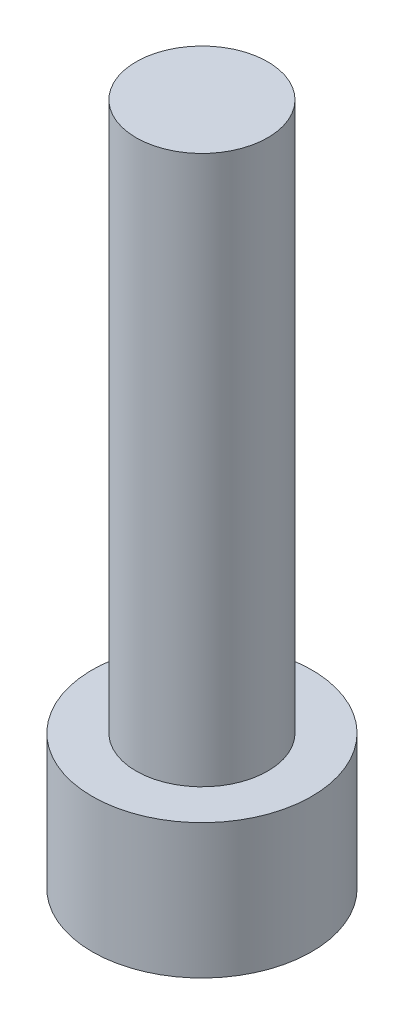
ISO-10303-21;
HEADER;
FILE_DESCRIPTION(('STEP AP214'),'2;1');
FILE_NAME('part.step','',(''),(''),'','','');
FILE_SCHEMA(('AUTOMOTIVE_DESIGN { 1 0 10303 214 1 1 1 1 }'));
ENDSEC;
DATA;
#1=APPLICATION_CONTEXT('core data for automotive mechanical design processes');
#2=APPLICATION_PROTOCOL_DEFINITION('international standard','automotive_design',2000,#1);
#3=PRODUCT_CONTEXT('',#1,'mechanical');
#4=PRODUCT('Part','Part','',(#3));
#5=PRODUCT_RELATED_PRODUCT_CATEGORY('part','',(#4));
#6=PRODUCT_DEFINITION_FORMATION('','',#4);
#7=PRODUCT_DEFINITION_CONTEXT('part definition',#1,'design');
#8=PRODUCT_DEFINITION('design','',#6,#7);
#9=PRODUCT_DEFINITION_SHAPE('','',#8);
#10=(LENGTH_UNIT() NAMED_UNIT(*) SI_UNIT(.MILLI.,.METRE.));
#11=(NAMED_UNIT(*) PLANE_ANGLE_UNIT() SI_UNIT($,.RADIAN.));
#12=(NAMED_UNIT(*) SI_UNIT($,.STERADIAN.) SOLID_ANGLE_UNIT());
#13=UNCERTAINTY_MEASURE_WITH_UNIT(LENGTH_MEASURE(1.E-05),#10,'distance_accuracy_value','');
#14=(GEOMETRIC_REPRESENTATION_CONTEXT(3) GLOBAL_UNCERTAINTY_ASSIGNED_CONTEXT((#13)) GLOBAL_UNIT_ASSIGNED_CONTEXT((#10,
#11,#12)) REPRESENTATION_CONTEXT('',''));
#15=CARTESIAN_POINT('',(0.,0.,0.));
#16=DIRECTION('',(0.,0.,1.));
#17=DIRECTION('',(1.,0.,0.));
#18=AXIS2_PLACEMENT_3D('',#15,#16,#17);
#19=CARTESIAN_POINT('',(0.,3.5052,0.));
#20=DIRECTION('',(0.,1.,0.));
#21=DIRECTION('',(0.,0.,1.));
#22=AXIS2_PLACEMENT_3D('',#19,#20,#21);
#23=PLANE('',#22);
#24=CARTESIAN_POINT('',(0.,3.5052,0.));
#25=DIRECTION('',(0.,1.,0.));
#26=DIRECTION('',(0.,0.,1.));
#27=AXIS2_PLACEMENT_3D('',#24,#25,#26);
#28=CIRCLE('',#27,2.8575);
#29=CARTESIAN_POINT('',(0.,3.5052,2.8575));
#30=VERTEX_POINT('',#29);
#31=EDGE_CURVE('E11',#30,#30,#28,.T.);
#32=ORIENTED_EDGE('',*,*,#31,.T.);
#33=EDGE_LOOP('',(#32));
#34=FACE_BOUND('',#33,.T.);
#35=CARTESIAN_POINT('',(0.,3.5052,0.));
#36=DIRECTION('',(0.,1.,0.));
#37=DIRECTION('',(0.,0.,1.));
#38=AXIS2_PLACEMENT_3D('',#35,#36,#37);
#39=CIRCLE('',#38,1.7145);
#40=CARTESIAN_POINT('',(0.,3.5052,1.7145));
#41=VERTEX_POINT('',#40);
#42=EDGE_CURVE('E152',#41,#41,#39,.T.);
#43=ORIENTED_EDGE('',*,*,#42,.F.);
#44=EDGE_LOOP('',(#43));
#45=FACE_BOUND('',#44,.T.);
#46=ADVANCED_FACE('F33',(#34,#45),#23,.T.);
#47=CARTESIAN_POINT('',(0.,3.5052,0.));
#48=DIRECTION('',(0.,-1.,0.));
#49=DIRECTION('',(0.,0.,-1.));
#50=AXIS2_PLACEMENT_3D('',#47,#48,#49);
#51=CYLINDRICAL_SURFACE('',#50,2.8575);
#52=ORIENTED_EDGE('',*,*,#31,.F.);
#53=EDGE_LOOP('',(#52));
#54=FACE_BOUND('',#53,.T.);
#55=CARTESIAN_POINT('',(0.,0.,0.));
#56=DIRECTION('',(0.,1.,0.));
#57=DIRECTION('',(0.,0.,1.));
#58=AXIS2_PLACEMENT_3D('',#55,#56,#57);
#59=CIRCLE('',#58,2.8575);
#60=CARTESIAN_POINT('',(0.,0.,2.8575));
#61=VERTEX_POINT('',#60);
#62=EDGE_CURVE('E37',#61,#61,#59,.T.);
#63=ORIENTED_EDGE('',*,*,#62,.T.);
#64=EDGE_LOOP('',(#63));
#65=FACE_BOUND('',#64,.T.);
#66=ADVANCED_FACE('F35',(#54,#65),#51,.T.);
#67=CARTESIAN_POINT('',(0.,0.,0.));
#68=DIRECTION('',(0.,1.,0.));
#69=DIRECTION('',(0.,0.,1.));
#70=AXIS2_PLACEMENT_3D('',#67,#68,#69);
#71=PLANE('',#70);
#72=DIRECTION('',(-0.500000000000001,0.,0.866025403784438));
#73=VECTOR('',#72,1.);
#74=CARTESIAN_POINT('',(1.60395121659243,0.,0.));
#75=LINE('',#74,#73);
#76=CARTESIAN_POINT('',(1.60395121659243,0.,0.));
#77=VERTEX_POINT('',#76);
#78=CARTESIAN_POINT('',(0.801975608296214,0.,1.3890625));
#79=VERTEX_POINT('',#78);
#80=EDGE_CURVE('E122',#77,#79,#75,.T.);
#81=ORIENTED_EDGE('',*,*,#80,.F.);
#82=DIRECTION('',(0.5,0.,0.866025403784439));
#83=VECTOR('',#82,1.);
#84=CARTESIAN_POINT('',(0.801975608296215,0.,-1.3890625));
#85=LINE('',#84,#83);
#86=CARTESIAN_POINT('',(0.801975608296215,0.,-1.3890625));
#87=VERTEX_POINT('',#86);
#88=EDGE_CURVE('E48',#87,#77,#85,.T.);
#89=ORIENTED_EDGE('',*,*,#88,.F.);
#90=DIRECTION('',(1.,0.,0.));
#91=VECTOR('',#90,1.);
#92=CARTESIAN_POINT('',(-0.801975608296214,0.,-1.3890625));
#93=LINE('',#92,#91);
#94=CARTESIAN_POINT('',(-0.801975608296214,0.,-1.3890625));
#95=VERTEX_POINT('',#94);
#96=EDGE_CURVE('E132',#95,#87,#93,.T.);
#97=ORIENTED_EDGE('',*,*,#96,.F.);
#98=DIRECTION('',(0.5,0.,-0.866025403784438));
#99=VECTOR('',#98,1.);
#100=CARTESIAN_POINT('',(-1.60395121659243,0.,0.));
#101=LINE('',#100,#99);
#102=CARTESIAN_POINT('',(-1.60395121659243,0.,0.));
#103=VERTEX_POINT('',#102);
#104=EDGE_CURVE('E130',#103,#95,#101,.T.);
#105=ORIENTED_EDGE('',*,*,#104,.F.);
#106=DIRECTION('',(-0.5,0.,-0.866025403784439));
#107=VECTOR('',#106,1.);
#108=CARTESIAN_POINT('',(-0.801975608296214,0.,1.3890625));
#109=LINE('',#108,#107);
#110=CARTESIAN_POINT('',(-0.801975608296214,0.,1.3890625));
#111=VERTEX_POINT('',#110);
#112=EDGE_CURVE('E96',#111,#103,#109,.T.);
#113=ORIENTED_EDGE('',*,*,#112,.F.);
#114=DIRECTION('',(-1.,0.,0.));
#115=VECTOR('',#114,1.);
#116=CARTESIAN_POINT('',(0.801975608296214,0.,1.3890625));
#117=LINE('',#116,#115);
#118=EDGE_CURVE('E126',#79,#111,#117,.T.);
#119=ORIENTED_EDGE('',*,*,#118,.F.);
#120=EDGE_LOOP('',(#81,#89,#97,#105,#113,#119));
#121=FACE_BOUND('',#120,.T.);
#122=ORIENTED_EDGE('',*,*,#62,.F.);
#123=EDGE_LOOP('',(#122));
#124=FACE_BOUND('',#123,.T.);
#125=ADVANCED_FACE('F145',(#121,#124),#71,.F.);
#126=CARTESIAN_POINT('',(0.801975608296215,1.9558,-1.3890625));
#127=DIRECTION('',(0.866025403784438,0.,-0.5));
#128=DIRECTION('',(-0.5,0.,-0.866025403784439));
#129=AXIS2_PLACEMENT_3D('',#126,#127,#128);
#130=PLANE('',#129);
#131=ORIENTED_EDGE('',*,*,#88,.T.);
#132=DIRECTION('',(0.,-1.,0.));
#133=VECTOR('',#132,1.);
#134=CARTESIAN_POINT('',(1.60395121659243,1.9558,0.));
#135=LINE('',#134,#133);
#136=CARTESIAN_POINT('',(1.60395121659243,1.9558,0.));
#137=VERTEX_POINT('',#136);
#138=EDGE_CURVE('E78',#137,#77,#135,.T.);
#139=ORIENTED_EDGE('',*,*,#138,.F.);
#140=DIRECTION('',(0.5,0.,0.866025403784439));
#141=VECTOR('',#140,1.);
#142=CARTESIAN_POINT('',(0.801975608296215,1.9558,-1.3890625));
#143=LINE('',#142,#141);
#144=CARTESIAN_POINT('',(0.801975608296215,1.9558,-1.3890625));
#145=VERTEX_POINT('',#144);
#146=EDGE_CURVE('E134',#145,#137,#143,.T.);
#147=ORIENTED_EDGE('',*,*,#146,.F.);
#148=DIRECTION('',(0.,-1.,0.));
#149=VECTOR('',#148,1.);
#150=CARTESIAN_POINT('',(0.801975608296215,1.9558,-1.3890625));
#151=LINE('',#150,#149);
#152=EDGE_CURVE('E56',#145,#87,#151,.T.);
#153=ORIENTED_EDGE('',*,*,#152,.T.);
#154=EDGE_LOOP('',(#131,#139,#147,#153));
#155=FACE_BOUND('',#154,.T.);
#156=ADVANCED_FACE('F174',(#155),#130,.F.);
#157=CARTESIAN_POINT('',(-0.801975608296214,1.9558,-1.3890625));
#158=DIRECTION('',(0.,0.,-1.));
#159=DIRECTION('',(-1.,0.,0.));
#160=AXIS2_PLACEMENT_3D('',#157,#158,#159);
#161=PLANE('',#160);
#162=ORIENTED_EDGE('',*,*,#96,.T.);
#163=ORIENTED_EDGE('',*,*,#152,.F.);
#164=DIRECTION('',(1.,0.,0.));
#165=VECTOR('',#164,1.);
#166=CARTESIAN_POINT('',(-0.801975608296214,1.9558,-1.3890625));
#167=LINE('',#166,#165);
#168=CARTESIAN_POINT('',(-0.801975608296214,1.9558,-1.3890625));
#169=VERTEX_POINT('',#168);
#170=EDGE_CURVE('E108',#169,#145,#167,.T.);
#171=ORIENTED_EDGE('',*,*,#170,.F.);
#172=DIRECTION('',(0.,-1.,0.));
#173=VECTOR('',#172,1.);
#174=CARTESIAN_POINT('',(-0.801975608296214,1.9558,-1.3890625));
#175=LINE('',#174,#173);
#176=EDGE_CURVE('E100',#169,#95,#175,.T.);
#177=ORIENTED_EDGE('',*,*,#176,.T.);
#178=EDGE_LOOP('',(#162,#163,#171,#177));
#179=FACE_BOUND('',#178,.T.);
#180=ADVANCED_FACE('F180',(#179),#161,.F.);
#181=CARTESIAN_POINT('',(-1.60395121659243,1.9558,0.));
#182=DIRECTION('',(-0.866025403784438,0.,-0.5));
#183=DIRECTION('',(-0.5,0.,0.866025403784439));
#184=AXIS2_PLACEMENT_3D('',#181,#182,#183);
#185=PLANE('',#184);
#186=ORIENTED_EDGE('',*,*,#104,.T.);
#187=ORIENTED_EDGE('',*,*,#176,.F.);
#188=DIRECTION('',(0.5,0.,-0.866025403784438));
#189=VECTOR('',#188,1.);
#190=CARTESIAN_POINT('',(-1.60395121659243,1.9558,0.));
#191=LINE('',#190,#189);
#192=CARTESIAN_POINT('',(-1.60395121659243,1.9558,0.));
#193=VERTEX_POINT('',#192);
#194=EDGE_CURVE('E104',#193,#169,#191,.T.);
#195=ORIENTED_EDGE('',*,*,#194,.F.);
#196=DIRECTION('',(0.,-1.,0.));
#197=VECTOR('',#196,1.);
#198=CARTESIAN_POINT('',(-1.60395121659243,1.9558,0.));
#199=LINE('',#198,#197);
#200=EDGE_CURVE('E89',#193,#103,#199,.T.);
#201=ORIENTED_EDGE('',*,*,#200,.T.);
#202=EDGE_LOOP('',(#186,#187,#195,#201));
#203=FACE_BOUND('',#202,.T.);
#204=ADVANCED_FACE('F105',(#203),#185,.F.);
#205=CARTESIAN_POINT('',(-0.801975608296214,1.9558,1.3890625));
#206=DIRECTION('',(-0.866025403784439,0.,0.5));
#207=DIRECTION('',(0.5,0.,0.866025403784439));
#208=AXIS2_PLACEMENT_3D('',#205,#206,#207);
#209=PLANE('',#208);
#210=ORIENTED_EDGE('',*,*,#112,.T.);
#211=ORIENTED_EDGE('',*,*,#200,.F.);
#212=DIRECTION('',(-0.5,0.,-0.866025403784439));
#213=VECTOR('',#212,1.);
#214=CARTESIAN_POINT('',(-0.801975608296214,1.9558,1.3890625));
#215=LINE('',#214,#213);
#216=CARTESIAN_POINT('',(-0.801975608296214,1.9558,1.3890625));
#217=VERTEX_POINT('',#216);
#218=EDGE_CURVE('E93',#217,#193,#215,.T.);
#219=ORIENTED_EDGE('',*,*,#218,.F.);
#220=DIRECTION('',(0.,-1.,0.));
#221=VECTOR('',#220,1.);
#222=CARTESIAN_POINT('',(-0.801975608296214,1.9558,1.3890625));
#223=LINE('',#222,#221);
#224=EDGE_CURVE('E101',#217,#111,#223,.T.);
#225=ORIENTED_EDGE('',*,*,#224,.T.);
#226=EDGE_LOOP('',(#210,#211,#219,#225));
#227=FACE_BOUND('',#226,.T.);
#228=ADVANCED_FACE('F91',(#227),#209,.F.);
#229=CARTESIAN_POINT('',(0.801975608296214,1.9558,1.3890625));
#230=DIRECTION('',(0.,0.,1.));
#231=DIRECTION('',(1.,0.,0.));
#232=AXIS2_PLACEMENT_3D('',#229,#230,#231);
#233=PLANE('',#232);
#234=ORIENTED_EDGE('',*,*,#118,.T.);
#235=ORIENTED_EDGE('',*,*,#224,.F.);
#236=DIRECTION('',(-1.,0.,0.));
#237=VECTOR('',#236,1.);
#238=CARTESIAN_POINT('',(0.801975608296214,1.9558,1.3890625));
#239=LINE('',#238,#237);
#240=CARTESIAN_POINT('',(0.801975608296214,1.9558,1.3890625));
#241=VERTEX_POINT('',#240);
#242=EDGE_CURVE('E114',#241,#217,#239,.T.);
#243=ORIENTED_EDGE('',*,*,#242,.F.);
#244=DIRECTION('',(0.,-1.,0.));
#245=VECTOR('',#244,1.);
#246=CARTESIAN_POINT('',(0.801975608296214,1.9558,1.3890625));
#247=LINE('',#246,#245);
#248=EDGE_CURVE('E138',#241,#79,#247,.T.);
#249=ORIENTED_EDGE('',*,*,#248,.T.);
#250=EDGE_LOOP('',(#234,#235,#243,#249));
#251=FACE_BOUND('',#250,.T.);
#252=ADVANCED_FACE('F149',(#251),#233,.F.);
#253=CARTESIAN_POINT('',(1.60395121659243,1.9558,0.));
#254=DIRECTION('',(0.866025403784438,0.,0.500000000000001));
#255=DIRECTION('',(0.500000000000001,0.,-0.866025403784438));
#256=AXIS2_PLACEMENT_3D('',#253,#254,#255);
#257=PLANE('',#256);
#258=ORIENTED_EDGE('',*,*,#80,.T.);
#259=ORIENTED_EDGE('',*,*,#248,.F.);
#260=DIRECTION('',(-0.500000000000001,0.,0.866025403784438));
#261=VECTOR('',#260,1.);
#262=CARTESIAN_POINT('',(1.60395121659243,1.9558,0.));
#263=LINE('',#262,#261);
#264=EDGE_CURVE('E116',#137,#241,#263,.T.);
#265=ORIENTED_EDGE('',*,*,#264,.F.);
#266=ORIENTED_EDGE('',*,*,#138,.T.);
#267=EDGE_LOOP('',(#258,#259,#265,#266));
#268=FACE_BOUND('',#267,.T.);
#269=ADVANCED_FACE('F142',(#268),#257,.F.);
#270=CARTESIAN_POINT('',(0.,1.9558,0.));
#271=DIRECTION('',(0.,-1.,0.));
#272=DIRECTION('',(0.,0.,-1.));
#273=AXIS2_PLACEMENT_3D('',#270,#271,#272);
#274=PLANE('',#273);
#275=ORIENTED_EDGE('',*,*,#146,.T.);
#276=ORIENTED_EDGE('',*,*,#264,.T.);
#277=ORIENTED_EDGE('',*,*,#242,.T.);
#278=ORIENTED_EDGE('',*,*,#218,.T.);
#279=ORIENTED_EDGE('',*,*,#194,.T.);
#280=ORIENTED_EDGE('',*,*,#170,.T.);
#281=EDGE_LOOP('',(#275,#276,#277,#278,#279,#280));
#282=FACE_BOUND('',#281,.T.);
#283=ADVANCED_FACE('F111',(#282),#274,.T.);
#284=CARTESIAN_POINT('',(0.,17.7927,0.));
#285=DIRECTION('',(0.,-1.,0.));
#286=DIRECTION('',(0.,0.,-1.));
#287=AXIS2_PLACEMENT_3D('',#284,#285,#286);
#288=CYLINDRICAL_SURFACE('',#287,1.7145);
#289=CARTESIAN_POINT('',(0.,17.7927,0.));
#290=DIRECTION('',(0.,1.,0.));
#291=DIRECTION('',(0.,0.,1.));
#292=AXIS2_PLACEMENT_3D('',#289,#290,#291);
#293=CIRCLE('',#292,1.7145);
#294=CARTESIAN_POINT('',(0.,17.7927,1.7145));
#295=VERTEX_POINT('',#294);
#296=EDGE_CURVE('E123',#295,#295,#293,.T.);
#297=ORIENTED_EDGE('',*,*,#296,.F.);
#298=EDGE_LOOP('',(#297));
#299=FACE_BOUND('',#298,.T.);
#300=ORIENTED_EDGE('',*,*,#42,.T.);
#301=EDGE_LOOP('',(#300));
#302=FACE_BOUND('',#301,.T.);
#303=ADVANCED_FACE('F160',(#299,#302),#288,.T.);
#304=CARTESIAN_POINT('',(0.,17.7927,0.));
#305=DIRECTION('',(0.,1.,0.));
#306=DIRECTION('',(0.,0.,1.));
#307=AXIS2_PLACEMENT_3D('',#304,#305,#306);
#308=PLANE('',#307);
#309=ORIENTED_EDGE('',*,*,#296,.T.);
#310=EDGE_LOOP('',(#309));
#311=FACE_BOUND('',#310,.T.);
#312=ADVANCED_FACE('F158',(#311),#308,.T.);
#313=CLOSED_SHELL('',(#46,#66,#125,#156,#180,#204,#228,#252,#269,#283,#303,#312));
#314=MANIFOLD_SOLID_BREP('B2',#313);
#315=ADVANCED_BREP_SHAPE_REPRESENTATION('',(#18,#314),#14);
#316=SHAPE_DEFINITION_REPRESENTATION(#9,#315);
ENDSEC;
END-ISO-10303-21;
